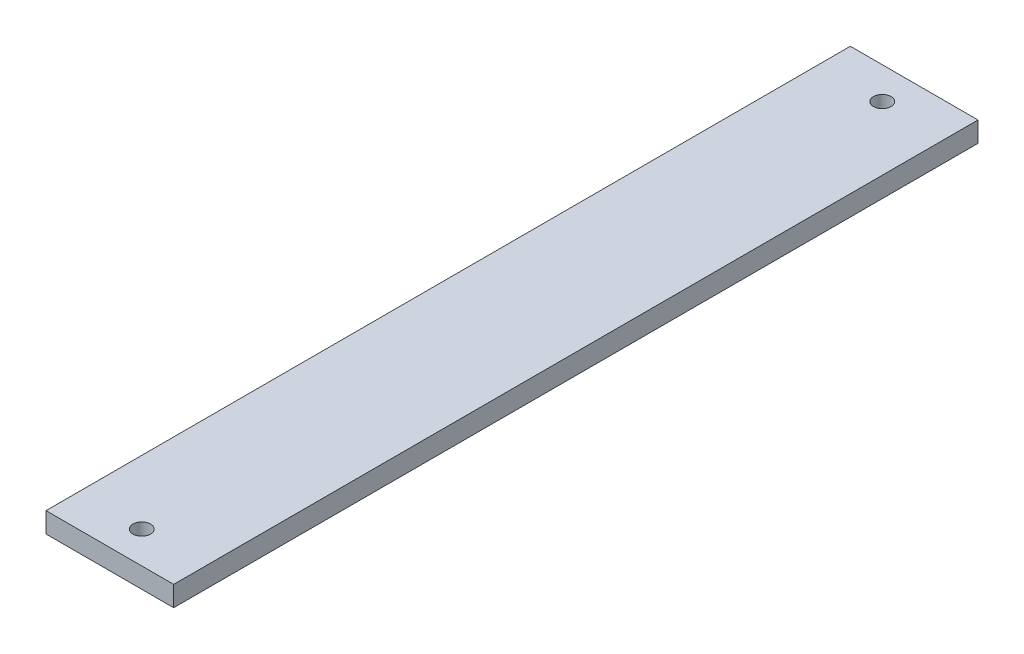
ISO-10303-21;
HEADER;
FILE_DESCRIPTION(('STEP AP214'),'2;1');
FILE_NAME('part.step','',(''),(''),'','','');
FILE_SCHEMA(('AUTOMOTIVE_DESIGN { 1 0 10303 214 1 1 1 1 }'));
ENDSEC;
DATA;
#1=APPLICATION_CONTEXT('core data for automotive mechanical design processes');
#2=APPLICATION_PROTOCOL_DEFINITION('international standard','automotive_design',2000,#1);
#3=PRODUCT_CONTEXT('',#1,'mechanical');
#4=PRODUCT('Part','Part','',(#3));
#5=PRODUCT_RELATED_PRODUCT_CATEGORY('part','',(#4));
#6=PRODUCT_DEFINITION_FORMATION('','',#4);
#7=PRODUCT_DEFINITION_CONTEXT('part definition',#1,'design');
#8=PRODUCT_DEFINITION('design','',#6,#7);
#9=PRODUCT_DEFINITION_SHAPE('','',#8);
#10=(LENGTH_UNIT() NAMED_UNIT(*) SI_UNIT(.MILLI.,.METRE.));
#11=(NAMED_UNIT(*) PLANE_ANGLE_UNIT() SI_UNIT($,.RADIAN.));
#12=(NAMED_UNIT(*) SI_UNIT($,.STERADIAN.) SOLID_ANGLE_UNIT());
#13=UNCERTAINTY_MEASURE_WITH_UNIT(LENGTH_MEASURE(1.E-05),#10,'distance_accuracy_value','');
#14=(GEOMETRIC_REPRESENTATION_CONTEXT(3) GLOBAL_UNCERTAINTY_ASSIGNED_CONTEXT((#13)) GLOBAL_UNIT_ASSIGNED_CONTEXT((#10,
#11,#12)) REPRESENTATION_CONTEXT('',''));
#15=CARTESIAN_POINT('',(0.,0.,0.));
#16=DIRECTION('',(0.,0.,1.));
#17=DIRECTION('',(1.,0.,0.));
#18=AXIS2_PLACEMENT_3D('',#15,#16,#17);
#19=CARTESIAN_POINT('',(0.,6.35,126.));
#20=DIRECTION('',(0.,0.,-1.));
#21=DIRECTION('',(-1.,0.,0.));
#22=AXIS2_PLACEMENT_3D('',#19,#20,#21);
#23=PLANE('',#22);
#24=DIRECTION('',(1.,0.,0.));
#25=VECTOR('',#24,1.);
#26=CARTESIAN_POINT('',(0.,0.,126.));
#27=LINE('',#26,#25);
#28=CARTESIAN_POINT('',(-20.,0.,126.));
#29=VERTEX_POINT('',#28);
#30=CARTESIAN_POINT('',(20.,0.,126.));
#31=VERTEX_POINT('',#30);
#32=EDGE_CURVE('E120',#29,#31,#27,.T.);
#33=ORIENTED_EDGE('',*,*,#32,.T.);
#34=DIRECTION('',(0.,-1.,0.));
#35=VECTOR('',#34,1.);
#36=CARTESIAN_POINT('',(20.,6.35,126.));
#37=LINE('',#36,#35);
#38=CARTESIAN_POINT('',(20.,6.35,126.));
#39=VERTEX_POINT('',#38);
#40=EDGE_CURVE('E11',#39,#31,#37,.T.);
#41=ORIENTED_EDGE('',*,*,#40,.F.);
#42=DIRECTION('',(1.,0.,0.));
#43=VECTOR('',#42,1.);
#44=CARTESIAN_POINT('',(0.,6.35,126.));
#45=LINE('',#44,#43);
#46=CARTESIAN_POINT('',(-20.,6.35,126.));
#47=VERTEX_POINT('',#46);
#48=EDGE_CURVE('E94',#47,#39,#45,.T.);
#49=ORIENTED_EDGE('',*,*,#48,.F.);
#50=DIRECTION('',(0.,-1.,0.));
#51=VECTOR('',#50,1.);
#52=CARTESIAN_POINT('',(-20.,6.35,126.));
#53=LINE('',#52,#51);
#54=EDGE_CURVE('E61',#47,#29,#53,.T.);
#55=ORIENTED_EDGE('',*,*,#54,.T.);
#56=EDGE_LOOP('',(#33,#41,#49,#55));
#57=FACE_BOUND('',#56,.T.);
#58=ADVANCED_FACE('F43',(#57),#23,.F.);
#59=CARTESIAN_POINT('',(20.,6.35,0.));
#60=DIRECTION('',(-1.,0.,0.));
#61=DIRECTION('',(0.,0.,1.));
#62=AXIS2_PLACEMENT_3D('',#59,#60,#61);
#63=PLANE('',#62);
#64=DIRECTION('',(0.,0.,-1.));
#65=VECTOR('',#64,1.);
#66=CARTESIAN_POINT('',(20.,0.,0.));
#67=LINE('',#66,#65);
#68=CARTESIAN_POINT('',(20.,0.,-126.));
#69=VERTEX_POINT('',#68);
#70=EDGE_CURVE('E100',#31,#69,#67,.T.);
#71=ORIENTED_EDGE('',*,*,#70,.T.);
#72=DIRECTION('',(0.,-1.,0.));
#73=VECTOR('',#72,1.);
#74=CARTESIAN_POINT('',(20.,6.35,-126.));
#75=LINE('',#74,#73);
#76=CARTESIAN_POINT('',(20.,6.35,-126.));
#77=VERTEX_POINT('',#76);
#78=EDGE_CURVE('E53',#77,#69,#75,.T.);
#79=ORIENTED_EDGE('',*,*,#78,.F.);
#80=DIRECTION('',(0.,0.,-1.));
#81=VECTOR('',#80,1.);
#82=CARTESIAN_POINT('',(20.,6.35,0.));
#83=LINE('',#82,#81);
#84=EDGE_CURVE('E86',#39,#77,#83,.T.);
#85=ORIENTED_EDGE('',*,*,#84,.F.);
#86=ORIENTED_EDGE('',*,*,#40,.T.);
#87=EDGE_LOOP('',(#71,#79,#85,#86));
#88=FACE_BOUND('',#87,.T.);
#89=ADVANCED_FACE('F99',(#88),#63,.F.);
#90=CARTESIAN_POINT('',(0.,6.35,-126.));
#91=DIRECTION('',(0.,0.,-1.));
#92=DIRECTION('',(-1.,0.,0.));
#93=AXIS2_PLACEMENT_3D('',#90,#91,#92);
#94=PLANE('',#93);
#95=DIRECTION('',(1.,0.,0.));
#96=VECTOR('',#95,1.);
#97=CARTESIAN_POINT('',(0.,0.,-126.));
#98=LINE('',#97,#96);
#99=CARTESIAN_POINT('',(-20.,0.,-126.));
#100=VERTEX_POINT('',#99);
#101=EDGE_CURVE('E125',#100,#69,#98,.T.);
#102=ORIENTED_EDGE('',*,*,#101,.F.);
#103=DIRECTION('',(0.,-1.,0.));
#104=VECTOR('',#103,1.);
#105=CARTESIAN_POINT('',(-20.,6.35,-126.));
#106=LINE('',#105,#104);
#107=CARTESIAN_POINT('',(-20.,6.35,-126.));
#108=VERTEX_POINT('',#107);
#109=EDGE_CURVE('E75',#108,#100,#106,.T.);
#110=ORIENTED_EDGE('',*,*,#109,.F.);
#111=DIRECTION('',(1.,0.,0.));
#112=VECTOR('',#111,1.);
#113=CARTESIAN_POINT('',(0.,6.35,-126.));
#114=LINE('',#113,#112);
#115=EDGE_CURVE('E93',#108,#77,#114,.T.);
#116=ORIENTED_EDGE('',*,*,#115,.T.);
#117=ORIENTED_EDGE('',*,*,#78,.T.);
#118=EDGE_LOOP('',(#102,#110,#116,#117));
#119=FACE_BOUND('',#118,.T.);
#120=ADVANCED_FACE('F104',(#119),#94,.T.);
#121=CARTESIAN_POINT('',(0.,6.35,-116.));
#122=DIRECTION('',(0.,-1.,0.));
#123=DIRECTION('',(0.,0.,-1.));
#124=AXIS2_PLACEMENT_3D('',#121,#122,#123);
#125=CYLINDRICAL_SURFACE('',#124,2.75);
#126=CARTESIAN_POINT('',(0.,6.35,-116.));
#127=DIRECTION('',(0.,1.,0.));
#128=DIRECTION('',(0.,0.,1.));
#129=AXIS2_PLACEMENT_3D('',#126,#127,#128);
#130=CIRCLE('',#129,2.75);
#131=CARTESIAN_POINT('',(0.,6.35,-113.25));
#132=VERTEX_POINT('',#131);
#133=EDGE_CURVE('E139',#132,#132,#130,.T.);
#134=ORIENTED_EDGE('',*,*,#133,.T.);
#135=EDGE_LOOP('',(#134));
#136=FACE_BOUND('',#135,.T.);
#137=CARTESIAN_POINT('',(0.,0.,-116.));
#138=DIRECTION('',(0.,1.,0.));
#139=DIRECTION('',(0.,0.,1.));
#140=AXIS2_PLACEMENT_3D('',#137,#138,#139);
#141=CIRCLE('',#140,2.75);
#142=CARTESIAN_POINT('',(0.,0.,-113.25));
#143=VERTEX_POINT('',#142);
#144=EDGE_CURVE('E116',#143,#143,#141,.T.);
#145=ORIENTED_EDGE('',*,*,#144,.F.);
#146=EDGE_LOOP('',(#145));
#147=FACE_BOUND('',#146,.T.);
#148=ADVANCED_FACE('F149',(#136,#147),#125,.F.);
#149=CARTESIAN_POINT('',(0.,6.35,116.));
#150=DIRECTION('',(0.,-1.,0.));
#151=DIRECTION('',(0.,0.,-1.));
#152=AXIS2_PLACEMENT_3D('',#149,#150,#151);
#153=CYLINDRICAL_SURFACE('',#152,2.75);
#154=CARTESIAN_POINT('',(0.,6.35,116.));
#155=DIRECTION('',(0.,1.,0.));
#156=DIRECTION('',(0.,0.,1.));
#157=AXIS2_PLACEMENT_3D('',#154,#155,#156);
#158=CIRCLE('',#157,2.75);
#159=CARTESIAN_POINT('',(0.,6.35,118.75));
#160=VERTEX_POINT('',#159);
#161=EDGE_CURVE('E132',#160,#160,#158,.T.);
#162=ORIENTED_EDGE('',*,*,#161,.T.);
#163=EDGE_LOOP('',(#162));
#164=FACE_BOUND('',#163,.T.);
#165=CARTESIAN_POINT('',(0.,0.,116.));
#166=DIRECTION('',(0.,1.,0.));
#167=DIRECTION('',(0.,0.,1.));
#168=AXIS2_PLACEMENT_3D('',#165,#166,#167);
#169=CIRCLE('',#168,2.75);
#170=CARTESIAN_POINT('',(0.,0.,118.75));
#171=VERTEX_POINT('',#170);
#172=EDGE_CURVE('E112',#171,#171,#169,.T.);
#173=ORIENTED_EDGE('',*,*,#172,.F.);
#174=EDGE_LOOP('',(#173));
#175=FACE_BOUND('',#174,.T.);
#176=ADVANCED_FACE('F45',(#164,#175),#153,.F.);
#177=CARTESIAN_POINT('',(-20.,6.35,0.));
#178=DIRECTION('',(-1.,0.,0.));
#179=DIRECTION('',(0.,0.,1.));
#180=AXIS2_PLACEMENT_3D('',#177,#178,#179);
#181=PLANE('',#180);
#182=DIRECTION('',(0.,0.,-1.));
#183=VECTOR('',#182,1.);
#184=CARTESIAN_POINT('',(-20.,0.,0.));
#185=LINE('',#184,#183);
#186=EDGE_CURVE('E128',#29,#100,#185,.T.);
#187=ORIENTED_EDGE('',*,*,#186,.F.);
#188=ORIENTED_EDGE('',*,*,#54,.F.);
#189=DIRECTION('',(0.,0.,-1.));
#190=VECTOR('',#189,1.);
#191=CARTESIAN_POINT('',(-20.,6.35,0.));
#192=LINE('',#191,#190);
#193=EDGE_CURVE('E106',#47,#108,#192,.T.);
#194=ORIENTED_EDGE('',*,*,#193,.T.);
#195=ORIENTED_EDGE('',*,*,#109,.T.);
#196=EDGE_LOOP('',(#187,#188,#194,#195));
#197=FACE_BOUND('',#196,.T.);
#198=ADVANCED_FACE('F154',(#197),#181,.T.);
#199=CARTESIAN_POINT('',(0.,6.35,0.));
#200=DIRECTION('',(0.,1.,0.));
#201=DIRECTION('',(0.,0.,1.));
#202=AXIS2_PLACEMENT_3D('',#199,#200,#201);
#203=PLANE('',#202);
#204=ORIENTED_EDGE('',*,*,#161,.F.);
#205=EDGE_LOOP('',(#204));
#206=FACE_BOUND('',#205,.T.);
#207=ORIENTED_EDGE('',*,*,#133,.F.);
#208=EDGE_LOOP('',(#207));
#209=FACE_BOUND('',#208,.T.);
#210=ORIENTED_EDGE('',*,*,#48,.T.);
#211=ORIENTED_EDGE('',*,*,#84,.T.);
#212=ORIENTED_EDGE('',*,*,#115,.F.);
#213=ORIENTED_EDGE('',*,*,#193,.F.);
#214=EDGE_LOOP('',(#210,#211,#212,#213));
#215=FACE_BOUND('',#214,.T.);
#216=ADVANCED_FACE('F90',(#206,#209,#215),#203,.T.);
#217=CARTESIAN_POINT('',(0.,0.,0.));
#218=DIRECTION('',(0.,1.,0.));
#219=DIRECTION('',(0.,0.,1.));
#220=AXIS2_PLACEMENT_3D('',#217,#218,#219);
#221=PLANE('',#220);
#222=ORIENTED_EDGE('',*,*,#172,.T.);
#223=EDGE_LOOP('',(#222));
#224=FACE_BOUND('',#223,.T.);
#225=ORIENTED_EDGE('',*,*,#144,.T.);
#226=EDGE_LOOP('',(#225));
#227=FACE_BOUND('',#226,.T.);
#228=ORIENTED_EDGE('',*,*,#32,.F.);
#229=ORIENTED_EDGE('',*,*,#186,.T.);
#230=ORIENTED_EDGE('',*,*,#101,.T.);
#231=ORIENTED_EDGE('',*,*,#70,.F.);
#232=EDGE_LOOP('',(#228,#229,#230,#231));
#233=FACE_BOUND('',#232,.T.);
#234=ADVANCED_FACE('F153',(#224,#227,#233),#221,.F.);
#235=CLOSED_SHELL('',(#58,#89,#120,#148,#176,#198,#216,#234));
#236=MANIFOLD_SOLID_BREP('B2',#235);
#237=ADVANCED_BREP_SHAPE_REPRESENTATION('',(#18,#236),#14);
#238=SHAPE_DEFINITION_REPRESENTATION(#9,#237);
ENDSEC;
END-ISO-10303-21;
